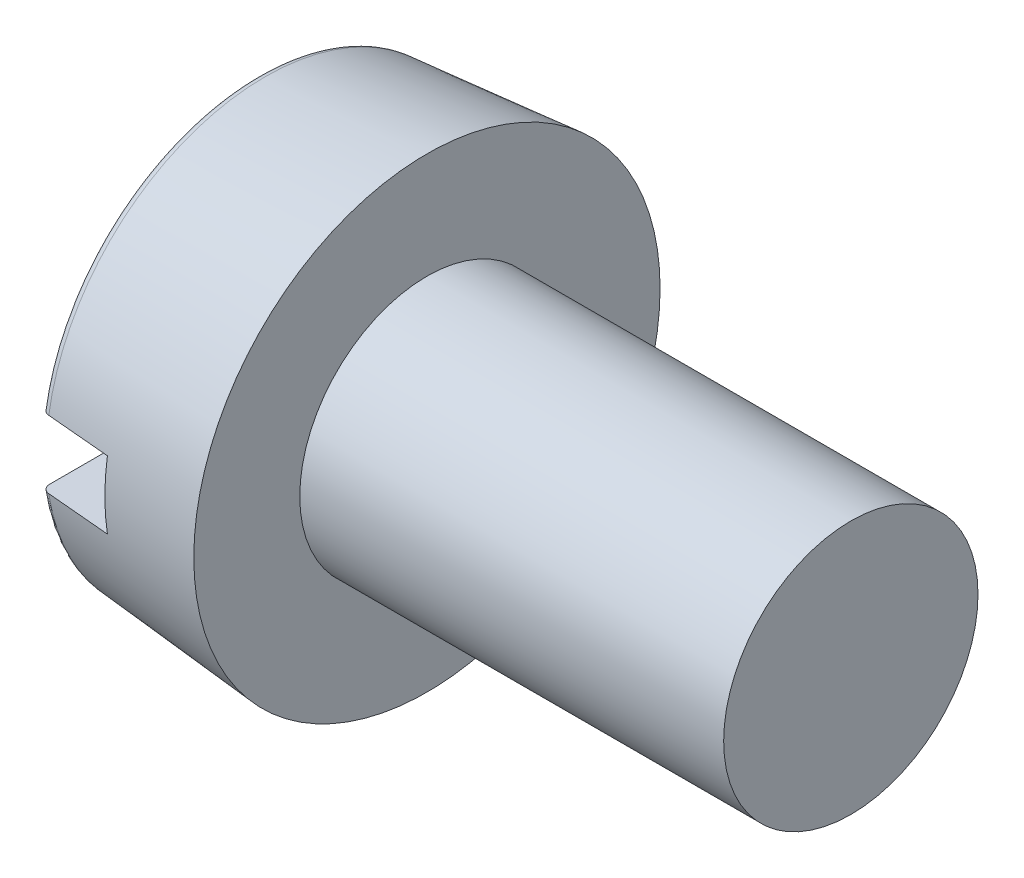
ISO-10303-21;
HEADER;
FILE_DESCRIPTION(('STEP AP214'),'2;1');
FILE_NAME('part.step','',(''),(''),'','','');
FILE_SCHEMA(('AUTOMOTIVE_DESIGN { 1 0 10303 214 1 1 1 1 }'));
ENDSEC;
DATA;
#1=APPLICATION_CONTEXT('core data for automotive mechanical design processes');
#2=APPLICATION_PROTOCOL_DEFINITION('international standard','automotive_design',2000,#1);
#3=PRODUCT_CONTEXT('',#1,'mechanical');
#4=PRODUCT('Part','Part','',(#3));
#5=PRODUCT_RELATED_PRODUCT_CATEGORY('part','',(#4));
#6=PRODUCT_DEFINITION_FORMATION('','',#4);
#7=PRODUCT_DEFINITION_CONTEXT('part definition',#1,'design');
#8=PRODUCT_DEFINITION('design','',#6,#7);
#9=PRODUCT_DEFINITION_SHAPE('','',#8);
#10=(LENGTH_UNIT() NAMED_UNIT(*) SI_UNIT(.MILLI.,.METRE.));
#11=(NAMED_UNIT(*) PLANE_ANGLE_UNIT() SI_UNIT($,.RADIAN.));
#12=(NAMED_UNIT(*) SI_UNIT($,.STERADIAN.) SOLID_ANGLE_UNIT());
#13=UNCERTAINTY_MEASURE_WITH_UNIT(LENGTH_MEASURE(1.E-05),#10,'distance_accuracy_value','');
#14=(GEOMETRIC_REPRESENTATION_CONTEXT(3) GLOBAL_UNCERTAINTY_ASSIGNED_CONTEXT((#13)) GLOBAL_UNIT_ASSIGNED_CONTEXT((#10,
#11,#12)) REPRESENTATION_CONTEXT('',''));
#15=CARTESIAN_POINT('',(0.,0.,0.));
#16=DIRECTION('',(0.,0.,1.));
#17=DIRECTION('',(1.,0.,0.));
#18=AXIS2_PLACEMENT_3D('',#15,#16,#17);
#19=CARTESIAN_POINT('',(0.,0.,0.));
#20=DIRECTION('',(-1.,0.,0.));
#21=DIRECTION('',(0.,0.,1.));
#22=AXIS2_PLACEMENT_3D('',#19,#20,#21);
#23=PLANE('',#22);
#24=DIRECTION('',(0.,0.,-1.));
#25=VECTOR('',#24,1.);
#26=CARTESIAN_POINT('',(0.,0.399999999999999,2.75));
#27=LINE('',#26,#25);
#28=CARTESIAN_POINT('',(0.,0.399999999999999,2.45096382768024));
#29=VERTEX_POINT('',#28);
#30=CARTESIAN_POINT('',(0.,0.399999999999999,-2.45096382768024));
#31=VERTEX_POINT('',#30);
#32=EDGE_CURVE('E99',#29,#31,#27,.T.);
#33=ORIENTED_EDGE('',*,*,#32,.F.);
#34=CARTESIAN_POINT('',(0.,0.,0.));
#35=DIRECTION('',(-1.,0.,0.));
#36=DIRECTION('',(0.,0.,1.));
#37=AXIS2_PLACEMENT_3D('',#34,#35,#36);
#38=CIRCLE('',#37,2.48338955554641);
#39=EDGE_CURVE('E101',#29,#31,#38,.T.);
#40=ORIENTED_EDGE('',*,*,#39,.T.);
#41=EDGE_LOOP('',(#33,#40));
#42=FACE_BOUND('',#41,.T.);
#43=ADVANCED_FACE('F31',(#42),#23,.T.);
#44=CARTESIAN_POINT('',(0.1,0.,0.));
#45=DIRECTION('',(-1.,0.,0.));
#46=DIRECTION('',(0.,0.,1.));
#47=AXIS2_PLACEMENT_3D('',#44,#45,#46);
#48=TOROIDAL_SURFACE('',#47,2.48338955554641,0.1);
#49=CARTESIAN_POINT('',(0.0485751661568925,0.399999999999999,-2.53782400375256));
#50=CARTESIAN_POINT('',(0.053335560648428,0.399999999999999,-2.54071333010714));
#51=CARTESIAN_POINT('',(0.0583417569081208,0.399999999999999,-2.5432050070476));
#52=CARTESIAN_POINT('',(0.0687050566270695,0.399999999999999,-2.54731542775851));
#53=CARTESIAN_POINT('',(0.074062533107433,0.399999999999999,-2.54893322616331));
#54=CARTESIAN_POINT('',(0.0849727450829088,0.399999999999999,-2.55124400653277));
#55=CARTESIAN_POINT('',(0.0905254381371258,0.399999999999999,-2.55193718825242));
#56=CARTESIAN_POINT('',(0.101666850403572,0.399999999999999,-2.55237774737396));
#57=CARTESIAN_POINT('',(0.107255560960916,0.399999999999999,-2.55212534411489));
#58=CARTESIAN_POINT('',(0.118292977477712,0.399999999999999,-2.55068537304434));
#59=CARTESIAN_POINT('',(0.123742072160621,0.399999999999999,-2.54950078182478));
#60=CARTESIAN_POINT('',(0.134364973548136,0.399999999999999,-2.54623584290948));
#61=CARTESIAN_POINT('',(0.139538770226996,0.399999999999999,-2.54415546261614));
#62=CARTESIAN_POINT('',(0.149479719032407,0.399999999999999,-2.53915450094368));
#63=CARTESIAN_POINT('',(0.154245774280699,0.399999999999999,-2.5362317402539));
#64=CARTESIAN_POINT('',(0.16322526708216,0.399999999999999,-2.52963434266422));
#65=CARTESIAN_POINT('',(0.167438683516509,0.399999999999999,-2.52595967704439));
#66=CARTESIAN_POINT('',(0.175235238754912,0.399999999999999,-2.51792797325945));
#67=CARTESIAN_POINT('',(0.178812290222122,0.399999999999999,-2.51356502728085));
#68=CARTESIAN_POINT('',(0.185193520606353,0.399999999999999,-2.50430657366979));
#69=CARTESIAN_POINT('',(0.187997652806075,0.399999999999999,-2.49941103387087));
#70=CARTESIAN_POINT('',(0.192789155673774,0.399999999999999,-2.48916309698215));
#71=CARTESIAN_POINT('',(0.194766254858682,0.399999999999999,-2.48380589705));
#72=CARTESIAN_POINT('',(0.197803265284973,0.399999999999999,-2.47283752208987));
#73=CARTESIAN_POINT('',(0.198863119308796,0.399999999999999,-2.46722633124097));
#74=CARTESIAN_POINT('',(0.200044847417698,0.399999999999999,-2.45584788057293));
#75=CARTESIAN_POINT('',(0.200157020578001,0.399999999999999,-2.45007961163345));
#76=CARTESIAN_POINT('',(0.199415505351017,0.399999999999999,-2.43860536306505));
#77=CARTESIAN_POINT('',(0.198561783586786,0.399999999999999,-2.43289938559553));
#78=CARTESIAN_POINT('',(0.195905910130036,0.399999999999999,-2.42168897882671));
#79=CARTESIAN_POINT('',(0.194100095750389,0.399999999999999,-2.41618541629421));
#80=CARTESIAN_POINT('',(0.189585917001447,0.399999999999999,-2.40556157634262));
#81=CARTESIAN_POINT('',(0.186877563222536,0.399999999999999,-2.40044129442698));
#82=CARTESIAN_POINT('',(0.180646274399763,0.399999999999999,-2.39075689405528));
#83=CARTESIAN_POINT('',(0.177127233156935,0.399999999999999,-2.38619027144736));
#84=CARTESIAN_POINT('',(0.16936410553569,0.399999999999999,-2.37772142685885));
#85=CARTESIAN_POINT('',(0.165120062398032,0.399999999999999,-2.37381916528196));
#86=CARTESIAN_POINT('',(0.15607995674928,0.399999999999999,-2.36683969538108));
#87=CARTESIAN_POINT('',(0.151290949374607,0.399999999999999,-2.36375335061032));
#88=CARTESIAN_POINT('',(0.141257231753731,0.399999999999999,-2.35844131597663));
#89=CARTESIAN_POINT('',(0.136012558112742,0.399999999999999,-2.35621555705808));
#90=CARTESIAN_POINT('',(0.125292467405882,0.399999999999999,-2.35271848818592));
#91=CARTESIAN_POINT('',(0.119821114682516,0.399999999999999,-2.35143471451816));
#92=CARTESIAN_POINT('',(0.10874007026053,0.399999999999999,-2.3498129641862));
#93=CARTESIAN_POINT('',(0.103130386873386,0.399999999999999,-2.34947493083703));
#94=CARTESIAN_POINT('',(0.0919839198921377,0.399999999999999,-2.34975394655982));
#95=CARTESIAN_POINT('',(0.0864469267457421,0.399999999999999,-2.3503627089689));
#96=CARTESIAN_POINT('',(0.0755538584306494,0.399999999999999,-2.35250103603832));
#97=CARTESIAN_POINT('',(0.070197781285211,0.399999999999999,-2.35403059063437));
#98=CARTESIAN_POINT('',(0.0598152881139394,0.399999999999999,-2.35796437216879));
#99=CARTESIAN_POINT('',(0.054788984276408,0.399999999999999,-2.36036889496734));
#100=CARTESIAN_POINT('',(0.0452064655420643,0.399999999999999,-2.36598034847398));
#101=CARTESIAN_POINT('',(0.0406502682628025,0.399999999999999,-2.36918730923854));
#102=CARTESIAN_POINT('',(0.0320917632238232,0.399999999999999,-2.37634229232291));
#103=CARTESIAN_POINT('',(0.028094870668272,0.399999999999999,-2.38029679006583));
#104=CARTESIAN_POINT('',(0.0208109892284708,0.399999999999999,-2.3888128469718));
#105=CARTESIAN_POINT('',(0.0175240500802504,0.399999999999999,-2.39337444862957));
#106=CARTESIAN_POINT('',(0.0117067345908032,0.399999999999999,-2.4030406846898));
#107=CARTESIAN_POINT('',(0.00918709442735062,0.399999999999999,-2.40815178065127));
#108=CARTESIAN_POINT('',(0.00503040363865618,0.399999999999999,-2.41872109198935));
#109=CARTESIAN_POINT('',(0.003393414118762,0.399999999999999,-2.42417933136926));
#110=CARTESIAN_POINT('',(0.00103079629344816,0.399999999999999,-2.4353556964236));
#111=CARTESIAN_POINT('',(0.000315915351137688,0.399999999999999,-2.44107609603135));
#112=CARTESIAN_POINT('',(-0.000148268658822335,0.399999999999999,-2.45255584173235));
#113=CARTESIAN_POINT('',(0.000102427694162917,0.399999999999999,-2.45831518780224));
#114=CARTESIAN_POINT('',(0.00156672863514033,0.399999999999999,-2.46973701475673));
#115=CARTESIAN_POINT('',(0.00278471258006267,0.399999999999999,-2.47539893515676));
#116=CARTESIAN_POINT('',(0.00615802275625762,0.399999999999999,-2.48643816300119));
#117=CARTESIAN_POINT('',(0.00831357182420383,0.399999999999999,-2.49181540244276));
#118=CARTESIAN_POINT('',(0.0134950186698162,0.399999999999999,-2.50210927446436));
#119=CARTESIAN_POINT('',(0.01651790853147,0.399999999999999,-2.50702742235159));
#120=CARTESIAN_POINT('',(0.0233527300396547,0.399999999999999,-2.51627478169689));
#121=CARTESIAN_POINT('',(0.0271636671469914,0.399999999999999,-2.52060472418424));
#122=CARTESIAN_POINT('',(0.0339390198940382,0.399999999999999,-2.52708853011278));
#123=CARTESIAN_POINT('',(0.0367007352855018,0.399999999999999,-2.52945777664795));
#124=CARTESIAN_POINT('',(0.04246511181425,0.399999999999999,-2.5338824942972));
#125=CARTESIAN_POINT('',(0.0454677714717278,0.399999999999999,-2.53593796733816));
#126=CARTESIAN_POINT('',(0.0485751661568925,0.399999999999999,-2.53782400375256));
#127=B_SPLINE_CURVE_WITH_KNOTS('',3,(#49,#50,#51,#52,#53,#54,#55,#56,#57,#58,#59,#60,#61,#62,
#63,#64,#65,#66,#67,#68,#69,#70,#71,#72,#73,#74,#75,#76,#77,#78,#79,#80,#81,#82,#83,#84,#85,#86,
#87,#88,#89,#90,#91,#92,#93,#94,#95,#96,#97,#98,#99,#100,#101,#102,#103,#104,#105,#106,#107,
#108,#109,#110,#111,#112,#113,#114,#115,#116,#117,#118,#119,#120,#121,#122,#123,#124,#125,#126),
.UNSPECIFIED.,.T.,.F.,(4,2,2,2,2,2,2,2,2,2,2,2,2,2,2,2,2,2,2,2,2,2,2,2,2,2,2,2,2,2,2,2,2,2,2,2,
2,2,4),(0.,0.0166927261929599,0.0334034746677627,0.0501106123530613,0.0668138748703243,
0.0834640171570519,0.100114765390758,0.116808983272006,0.133503838928812,0.150350686192216,
0.167198551500755,0.184249859151125,0.201302230381806,0.218528949163409,0.235756263240368,
0.253050339384405,0.270344212607132,0.287556692602934,0.304768146365554,0.321777815466104,
0.338786119383575,0.355565109802712,0.372343094515803,0.388975057176047,0.405606838051781,
0.422244248001944,0.438882281223626,0.455671655511418,0.472462205603378,0.489477908753089,
0.506494789738005,0.523708265225892,0.54092173038536,0.558213576203892,0.575509534125873,
0.592746220451118,0.609961284890882,0.620857694274182,0.631754036740157),.UNSPECIFIED.);
#128=CARTESIAN_POINT('',(0.0912844257247948,0.399999999999999,-2.55184945188353));
#129=VERTEX_POINT('',#128);
#130=EDGE_CURVE('E55',#31,#129,#127,.T.);
#131=ORIENTED_EDGE('',*,*,#130,.F.);
#132=ORIENTED_EDGE('',*,*,#39,.F.);
#133=CARTESIAN_POINT('',(0.066087136792476,0.399999999999999,2.35559521523855));
#134=CARTESIAN_POINT('',(0.0712950927848418,0.399999999999999,2.35369117822232));
#135=CARTESIAN_POINT('',(0.076666857041321,0.399999999999999,2.35222401932616));
#136=CARTESIAN_POINT('',(0.0875846729626109,0.399999999999999,2.35021144655486));
#137=CARTESIAN_POINT('',(0.0931309090012406,0.399999999999999,2.34966704357885));
#138=CARTESIAN_POINT('',(0.104234345782761,0.399999999999999,2.34951890222007));
#139=CARTESIAN_POINT('',(0.109791541651094,0.399999999999999,2.34991481223107));
#140=CARTESIAN_POINT('',(0.120758977338573,0.399999999999999,2.35163438903106));
#141=CARTESIAN_POINT('',(0.126169249425605,0.399999999999999,2.3529578503682));
#142=CARTESIAN_POINT('',(0.136691070159669,0.399999999999999,2.35649136337689));
#143=CARTESIAN_POINT('',(0.141802658139018,0.399999999999999,2.35870129801009));
#144=CARTESIAN_POINT('',(0.151586618009318,0.399999999999999,2.36394124838263));
#145=CARTESIAN_POINT('',(0.15625896099778,0.399999999999999,2.36697131803635));
#146=CARTESIAN_POINT('',(0.165074157354303,0.399999999999999,2.37379047063628));
#147=CARTESIAN_POINT('',(0.169212326798595,0.399999999999999,2.37758560642957));
#148=CARTESIAN_POINT('',(0.176803016968956,0.399999999999999,2.38580863243915));
#149=CARTESIAN_POINT('',(0.180255493017442,0.399999999999999,2.39023656385407));
#150=CARTESIAN_POINT('',(0.186425395678719,0.399999999999999,2.39966205876259));
#151=CARTESIAN_POINT('',(0.189132494897016,0.399999999999999,2.40466638257535));
#152=CARTESIAN_POINT('',(0.19367967078828,0.399999999999999,2.41505452836032));
#153=CARTESIAN_POINT('',(0.195519689004032,0.399999999999999,2.42043837589129));
#154=CARTESIAN_POINT('',(0.19830186658775,0.399999999999999,2.43150243878165));
#155=CARTESIAN_POINT('',(0.199232942923701,0.399999999999999,2.43718544303413));
#156=CARTESIAN_POINT('',(0.200133721631402,0.399999999999999,2.44862724862863));
#157=CARTESIAN_POINT('',(0.200103382520145,0.399999999999999,2.45438605323057));
#158=CARTESIAN_POINT('',(0.199078617330099,0.399999999999999,2.46584997721002));
#159=CARTESIAN_POINT('',(0.198078795088567,0.399999999999999,2.47155461557154));
#160=CARTESIAN_POINT('',(0.195132850395625,0.399999999999999,2.48271426222291));
#161=CARTESIAN_POINT('',(0.193186731461064,0.399999999999999,2.4881692714404));
#162=CARTESIAN_POINT('',(0.188406932533007,0.399999999999999,2.49865615099338));
#163=CARTESIAN_POINT('',(0.185575905837541,0.399999999999999,2.50368922996592));
#164=CARTESIAN_POINT('',(0.179101091115396,0.399999999999999,2.51320240525564));
#165=CARTESIAN_POINT('',(0.175457341207139,0.399999999999999,2.51768252749234));
#166=CARTESIAN_POINT('',(0.167497937800453,0.399999999999999,2.52591455321073));
#167=CARTESIAN_POINT('',(0.16318924419314,0.399999999999999,2.52967318474522));
#168=CARTESIAN_POINT('',(0.15399533800476,0.399999999999999,2.53640297535422));
#169=CARTESIAN_POINT('',(0.149110165043672,0.399999999999999,2.53937418850051));
#170=CARTESIAN_POINT('',(0.138966186483439,0.399999999999999,2.54440671179074));
#171=CARTESIAN_POINT('',(0.133712676926899,0.399999999999999,2.54647869854793));
#172=CARTESIAN_POINT('',(0.122930387636138,0.399999999999999,2.54970170625043));
#173=CARTESIAN_POINT('',(0.117401624409889,0.399999999999999,2.55085278235563));
#174=CARTESIAN_POINT('',(0.106281963774287,0.399999999999999,2.55219206612031));
#175=CARTESIAN_POINT('',(0.100692150468509,0.399999999999999,2.55238928817214));
#176=CARTESIAN_POINT('',(0.0895592860464738,0.399999999999999,2.55183933800322));
#177=CARTESIAN_POINT('',(0.0840162336332734,0.399999999999999,2.55109219206242));
#178=CARTESIAN_POINT('',(0.0731512358601828,0.399999999999999,2.5486799701557));
#179=CARTESIAN_POINT('',(0.0678286781135663,0.399999999999999,2.54701764956405));
#180=CARTESIAN_POINT('',(0.0575363587723267,0.399999999999999,2.54282694850188));
#181=CARTESIAN_POINT('',(0.0525666019474384,0.399999999999999,2.54029855632511));
#182=CARTESIAN_POINT('',(0.0430955298033923,0.399999999999999,2.53443716654266));
#183=CARTESIAN_POINT('',(0.03859644697394,0.399999999999999,2.53110056307376));
#184=CARTESIAN_POINT('',(0.0302151234190859,0.399999999999999,2.52372648341994));
#185=CARTESIAN_POINT('',(0.026332911338312,0.399999999999999,2.51968897470644));
#186=CARTESIAN_POINT('',(0.0192521281963954,0.399999999999999,2.51098384815932));
#187=CARTESIAN_POINT('',(0.0160610119836794,0.399999999999999,2.5063101674796));
#188=CARTESIAN_POINT('',(0.0104977647710904,0.399999999999999,2.49649850826803));
#189=CARTESIAN_POINT('',(0.00812568805622457,0.399999999999999,2.49136049898949));
#190=CARTESIAN_POINT('',(0.00423822124527566,0.399999999999999,2.48069955197134));
#191=CARTESIAN_POINT('',(0.00273352009700192,0.399999999999999,2.4751727157723));
#192=CARTESIAN_POINT('',(0.000664174238575977,0.399999999999999,2.4639457200927));
#193=CARTESIAN_POINT('',(9.95845082644665E-05,0.399999999999999,2.45824555049506));
#194=CARTESIAN_POINT('',(-7.62295306056618E-05,0.399999999999999,2.4467793069312));
#195=CARTESIAN_POINT('',(0.000321125140370979,0.399999999999999,2.44101309976124));
#196=CARTESIAN_POINT('',(0.00207635443678277,0.399999999999999,2.42962883569641));
#197=CARTESIAN_POINT('',(0.00343421550729716,0.399999999999999,2.424010776712));
#198=CARTESIAN_POINT('',(0.00707734815742831,0.399999999999999,2.41307368443565));
#199=CARTESIAN_POINT('',(0.00936409323791634,0.399999999999999,2.40775514160471));
#200=CARTESIAN_POINT('',(0.014804690681413,0.399999999999999,2.39757966614318));
#201=CARTESIAN_POINT('',(0.0179587364122395,0.399999999999999,2.39272283677864));
#202=CARTESIAN_POINT('',(0.0250240732994685,0.399999999999999,2.38364579035037));
#203=CARTESIAN_POINT('',(0.0289303931825737,0.399999999999999,2.37942170099146));
#204=CARTESIAN_POINT('',(0.0374021808573999,0.399999999999999,2.3717039963052));
#205=CARTESIAN_POINT('',(0.0419667955357711,0.399999999999999,2.36820944966134));
#206=CARTESIAN_POINT('',(0.0498248602432996,0.399999999999999,2.3632007701384));
#207=CARTESIAN_POINT('',(0.0529598990957766,0.399999999999999,2.36143340044221));
#208=CARTESIAN_POINT('',(0.0594027181877445,0.399999999999999,2.35824787663633));
#209=CARTESIAN_POINT('',(0.062710497205202,0.399999999999999,2.35682972005658));
#210=CARTESIAN_POINT('',(0.066087136792476,0.399999999999999,2.35559521523855));
#211=B_SPLINE_CURVE_WITH_KNOTS('',3,(#133,#134,#135,#136,#137,#138,#139,#140,#141,#142,#143,
#144,#145,#146,#147,#148,#149,#150,#151,#152,#153,#154,#155,#156,#157,#158,#159,#160,#161,#162,
#163,#164,#165,#166,#167,#168,#169,#170,#171,#172,#173,#174,#175,#176,#177,#178,#179,#180,#181,
#182,#183,#184,#185,#186,#187,#188,#189,#190,#191,#192,#193,#194,#195,#196,#197,#198,#199,#200,
#201,#202,#203,#204,#205,#206,#207,#208,#209,#210),.UNSPECIFIED.,.T.,.F.,(4,2,2,2,2,2,2,2,2,2,2,
2,2,2,2,2,2,2,2,2,2,2,2,2,2,2,2,2,2,2,2,2,2,2,2,2,2,2,4),(0.,0.0166222541478177,
0.0332627065942929,0.0498969377445997,0.0665274855903878,0.0831558384784712,0.0997852847538594,
0.116551858795266,0.133319524934732,0.150308994702433,0.16729960970923,0.184494901354411,
0.201690934940426,0.218983234681923,0.236275470158237,0.253516346249615,0.270756413877768,
0.287826942378045,0.304896298346318,0.321757040586668,0.338616772841758,0.355316856730833,
0.372016475898998,0.388666089268513,0.405315927691637,0.422041464353441,0.438767777445074,
0.455666404024134,0.472566150410065,0.489669935249993,0.506774720322791,0.524032613353522,
0.541290262841154,0.558575395944134,0.575864385959096,0.593042819367108,0.610199187265656,
0.620976497689188,0.631753731880016),.UNSPECIFIED.);
#212=CARTESIAN_POINT('',(0.0912844257242457,0.399999999999999,2.55184945188577));
#213=VERTEX_POINT('',#212);
#214=EDGE_CURVE('E91',#213,#29,#211,.T.);
#215=ORIENTED_EDGE('',*,*,#214,.F.);
#216=CARTESIAN_POINT('',(0.0912844257252333,0.,0.));
#217=DIRECTION('',(-1.,0.,0.));
#218=DIRECTION('',(0.,0.,1.));
#219=AXIS2_PLACEMENT_3D('',#216,#217,#218);
#220=CIRCLE('',#219,2.58300902535558);
#221=EDGE_CURVE('E105',#129,#213,#220,.F.);
#222=ORIENTED_EDGE('',*,*,#221,.F.);
#223=EDGE_LOOP('',(#131,#132,#215,#222));
#224=FACE_BOUND('',#223,.T.);
#225=ADVANCED_FACE('F176',(#224),#48,.T.);
#226=CARTESIAN_POINT('',(-25.4,0.,0.));
#227=DIRECTION('',(-1.,0.,0.));
#228=DIRECTION('',(0.,0.,1.));
#229=AXIS2_PLACEMENT_3D('',#226,#227,#228);
#230=CYLINDRICAL_SURFACE('',#229,1.5);
#231=CARTESIAN_POINT('',(7.,0.,0.));
#232=DIRECTION('',(-1.,0.,0.));
#233=DIRECTION('',(0.,0.,1.));
#234=AXIS2_PLACEMENT_3D('',#231,#232,#233);
#235=CIRCLE('',#234,1.5);
#236=CARTESIAN_POINT('',(7.,0.,1.5));
#237=VERTEX_POINT('',#236);
#238=EDGE_CURVE('E102',#237,#237,#235,.T.);
#239=ORIENTED_EDGE('',*,*,#238,.T.);
#240=EDGE_LOOP('',(#239));
#241=FACE_BOUND('',#240,.T.);
#242=CARTESIAN_POINT('',(2.,0.,0.));
#243=DIRECTION('',(-1.,0.,0.));
#244=DIRECTION('',(0.,0.,1.));
#245=AXIS2_PLACEMENT_3D('',#242,#243,#244);
#246=CIRCLE('',#245,1.5);
#247=CARTESIAN_POINT('',(2.,0.,1.5));
#248=VERTEX_POINT('',#247);
#249=EDGE_CURVE('E163',#248,#248,#246,.T.);
#250=ORIENTED_EDGE('',*,*,#249,.F.);
#251=EDGE_LOOP('',(#250));
#252=FACE_BOUND('',#251,.T.);
#253=ADVANCED_FACE('F173',(#241,#252),#230,.T.);
#254=CARTESIAN_POINT('',(7.,1.5,0.));
#255=DIRECTION('',(1.,0.,0.));
#256=DIRECTION('',(0.,0.,-1.));
#257=AXIS2_PLACEMENT_3D('',#254,#255,#256);
#258=PLANE('',#257);
#259=ORIENTED_EDGE('',*,*,#238,.F.);
#260=EDGE_LOOP('',(#259));
#261=FACE_BOUND('',#260,.T.);
#262=ADVANCED_FACE('F175',(#261),#258,.T.);
#263=DIRECTION('',(0.,0.,1.));
#264=VECTOR('',#263,1.);
#265=CARTESIAN_POINT('',(0.,-0.4,-2.75));
#266=LINE('',#265,#264);
#267=CARTESIAN_POINT('',(0.,-0.4,-2.45096382768024));
#268=VERTEX_POINT('',#267);
#269=CARTESIAN_POINT('',(0.,-0.4,2.45096382768024));
#270=VERTEX_POINT('',#269);
#271=EDGE_CURVE('E47',#268,#270,#266,.T.);
#272=ORIENTED_EDGE('',*,*,#271,.F.);
#273=EDGE_CURVE('E97',#268,#270,#38,.T.);
#274=ORIENTED_EDGE('',*,*,#273,.T.);
#275=EDGE_LOOP('',(#272,#274));
#276=FACE_BOUND('',#275,.T.);
#277=ADVANCED_FACE('F96',(#276),#23,.T.);
#278=CARTESIAN_POINT('',(0.,0.,0.));
#279=DIRECTION('',(1.,0.,0.));
#280=DIRECTION('',(0.,0.,-1.));
#281=AXIS2_PLACEMENT_3D('',#278,#279,#280);
#282=CONICAL_SURFACE('',#281,2.57502267294815,0.0872664625997164);
#283=CARTESIAN_POINT('',(5.21123588736544,0.399999999999999,3.00443640584799));
#284=CARTESIAN_POINT('',(4.41342358696222,0.399999999999999,2.93401988873196));
#285=CARTESIAN_POINT('',(3.61561486907634,0.399999999999999,2.86356274948076));
#286=CARTESIAN_POINT('',(2.0200069246513,0.399999999999999,2.72254136292326));
#287=CARTESIAN_POINT('',(1.22220769811185,0.399999999999999,2.65197711562021));
#288=CARTESIAN_POINT('',(-0.373378996688641,0.399999999999999,2.51071564393346));
#289=CARTESIAN_POINT('',(-1.17116646494953,0.399999999999999,2.44001841954794));
#290=CARTESIAN_POINT('',(-2.76672581923324,0.399999999999999,2.298448092182));
#291=CARTESIAN_POINT('',(-3.56449770525557,0.399999999999999,2.22757498919618));
#292=CARTESIAN_POINT('',(-4.36225986914578,0.399999999999999,2.15659249784001));
#293=B_SPLINE_CURVE_WITH_KNOTS('',3,(#283,#284,#285,#286,#287,#288,#289,#290,#291,#292),
.UNSPECIFIED.,.F.,.F.,(4,2,2,2,4),(0.,2.40274147318214,4.80548287330205,7.20822430613117,
9.6109658126378),.UNSPECIFIED.);
#294=CARTESIAN_POINT('',(0.85,0.399999999999999,2.61901832187334));
#295=VERTEX_POINT('',#294);
#296=EDGE_CURVE('E154',#295,#213,#293,.T.);
#297=ORIENTED_EDGE('',*,*,#296,.F.);
#298=CARTESIAN_POINT('',(0.85,0.,0.));
#299=DIRECTION('',(1.,0.,0.));
#300=DIRECTION('',(0.,0.,-1.));
#301=AXIS2_PLACEMENT_3D('',#298,#299,#300);
#302=CIRCLE('',#301,2.64938803694519);
#303=CARTESIAN_POINT('',(0.85,-0.4,2.61901832187334));
#304=VERTEX_POINT('',#303);
#305=EDGE_CURVE('E11',#304,#295,#302,.F.);
#306=ORIENTED_EDGE('',*,*,#305,.F.);
#307=CARTESIAN_POINT('',(-4.36225986914578,-0.4,2.15659249784001));
#308=CARTESIAN_POINT('',(-3.0225287932993,-0.4,2.27578971400985));
#309=CARTESIAN_POINT('',(-1.68277158070832,-0.4,2.3946924855258));
#310=CARTESIAN_POINT('',(-0.087192971572953,-0.4,2.5360455579839));
#311=CARTESIAN_POINT('',(0.168610376643268,-0.4,2.55869953286896));
#312=CARTESIAN_POINT('',(2.02000114161503,-0.4,2.72260692865391));
#313=CARTESIAN_POINT('',(3.61561248830953,-0.4,2.86359016848939));
#314=CARTESIAN_POINT('',(5.21123588736544,-0.4,3.00443640584799));
#315=B_SPLINE_CURVE_WITH_KNOTS('',3,(#307,#308,#309,#310,#311,#312,#313,#314),.UNSPECIFIED.,.F.,
.F.,(4,2,2,4),(0.,4.03506939923899,4.80548292410975,9.61096578658458),.UNSPECIFIED.);
#316=CARTESIAN_POINT('',(0.0912844257252334,-0.4,2.5518494518816));
#317=VERTEX_POINT('',#316);
#318=EDGE_CURVE('E132',#317,#304,#315,.T.);
#319=ORIENTED_EDGE('',*,*,#318,.F.);
#320=CARTESIAN_POINT('',(0.0912844257252334,-0.4,-2.55184945188164));
#321=VERTEX_POINT('',#320);
#322=EDGE_CURVE('E111',#317,#321,#220,.F.);
#323=ORIENTED_EDGE('',*,*,#322,.T.);
#324=CARTESIAN_POINT('',(5.21123588736544,-0.4,-3.00443640584799));
#325=CARTESIAN_POINT('',(4.41342358696222,-0.4,-2.93401988873196));
#326=CARTESIAN_POINT('',(3.61561486907634,-0.4,-2.86356274948076));
#327=CARTESIAN_POINT('',(2.0200069246513,-0.4,-2.72254136292326));
#328=CARTESIAN_POINT('',(1.22220769811185,-0.4,-2.65197711562021));
#329=CARTESIAN_POINT('',(-0.373378996688641,-0.4,-2.51071564393346));
#330=CARTESIAN_POINT('',(-1.17116646494953,-0.4,-2.44001841954794));
#331=CARTESIAN_POINT('',(-2.76672581923324,-0.4,-2.298448092182));
#332=CARTESIAN_POINT('',(-3.56449770525557,-0.4,-2.22757498919618));
#333=CARTESIAN_POINT('',(-4.36225986914578,-0.4,-2.15659249784001));
#334=B_SPLINE_CURVE_WITH_KNOTS('',3,(#324,#325,#326,#327,#328,#329,#330,#331,#332,#333),
.UNSPECIFIED.,.F.,.F.,(4,2,2,2,4),(0.,2.40274147318214,4.80548287330205,7.20822430613117,
9.6109658126378),.UNSPECIFIED.);
#335=CARTESIAN_POINT('',(0.85,-0.4,-2.61901832187334));
#336=VERTEX_POINT('',#335);
#337=EDGE_CURVE('E86',#336,#321,#334,.T.);
#338=ORIENTED_EDGE('',*,*,#337,.F.);
#339=CARTESIAN_POINT('',(0.85,0.399999999999999,-2.61901832187334));
#340=VERTEX_POINT('',#339);
#341=EDGE_CURVE('E36',#340,#336,#302,.F.);
#342=ORIENTED_EDGE('',*,*,#341,.F.);
#343=CARTESIAN_POINT('',(-4.36225986914578,0.399999999999999,-2.15659249784001));
#344=CARTESIAN_POINT('',(-3.0225287932993,0.399999999999999,-2.27578971400985));
#345=CARTESIAN_POINT('',(-1.68277158070832,0.399999999999999,-2.3946924855258));
#346=CARTESIAN_POINT('',(-0.087192971572953,0.399999999999999,-2.5360455579839));
#347=CARTESIAN_POINT('',(0.168610376643268,0.399999999999999,-2.55869953286896));
#348=CARTESIAN_POINT('',(2.02000114161503,0.399999999999999,-2.72260692865391));
#349=CARTESIAN_POINT('',(3.61561248830953,0.399999999999999,-2.86359016848939));
#350=CARTESIAN_POINT('',(5.21123588736544,0.399999999999999,-3.00443640584799));
#351=B_SPLINE_CURVE_WITH_KNOTS('',3,(#343,#344,#345,#346,#347,#348,#349,#350),.UNSPECIFIED.,.F.,
.F.,(4,2,2,4),(0.,4.03506939923899,4.80548292410975,9.61096578658458),.UNSPECIFIED.);
#352=EDGE_CURVE('E158',#129,#340,#351,.T.);
#353=ORIENTED_EDGE('',*,*,#352,.F.);
#354=ORIENTED_EDGE('',*,*,#221,.T.);
#355=EDGE_LOOP('',(#297,#306,#319,#323,#338,#342,#353,#354));
#356=FACE_BOUND('',#355,.T.);
#357=CARTESIAN_POINT('',(2.,0.,0.));
#358=DIRECTION('',(-1.,0.,0.));
#359=DIRECTION('',(0.,0.,1.));
#360=AXIS2_PLACEMENT_3D('',#357,#358,#359);
#361=CIRCLE('',#360,2.75);
#362=CARTESIAN_POINT('',(2.,0.,2.75));
#363=VERTEX_POINT('',#362);
#364=EDGE_CURVE('E107',#363,#363,#361,.T.);
#365=ORIENTED_EDGE('',*,*,#364,.T.);
#366=EDGE_LOOP('',(#365));
#367=FACE_BOUND('',#366,.T.);
#368=ADVANCED_FACE('F143',(#356,#367),#282,.T.);
#369=CARTESIAN_POINT('',(2.,1.5,0.));
#370=DIRECTION('',(-1.,0.,0.));
#371=DIRECTION('',(0.,0.,1.));
#372=AXIS2_PLACEMENT_3D('',#369,#370,#371);
#373=PLANE('',#372);
#374=ORIENTED_EDGE('',*,*,#364,.F.);
#375=EDGE_LOOP('',(#374));
#376=FACE_BOUND('',#375,.T.);
#377=ORIENTED_EDGE('',*,*,#249,.T.);
#378=EDGE_LOOP('',(#377));
#379=FACE_BOUND('',#378,.T.);
#380=ADVANCED_FACE('F147',(#376,#379),#373,.F.);
#381=CARTESIAN_POINT('',(0.0485751661568924,-0.4,-2.53782400375256));
#382=CARTESIAN_POINT('',(0.043742700889073,-0.4,-2.53489033603248));
#383=CARTESIAN_POINT('',(0.0391565039520058,-0.4,-2.53154249233901));
#384=CARTESIAN_POINT('',(0.0306096912349645,-0.4,-2.52411912703245));
#385=CARTESIAN_POINT('',(0.0266499199134283,-0.4,-2.52004263865816));
#386=CARTESIAN_POINT('',(0.0194724144414637,-0.4,-2.51128827187889));
#387=CARTESIAN_POINT('',(0.0162539430758686,-0.4,-2.5066109982245));
#388=CARTESIAN_POINT('',(0.0106407914468132,-0.4,-2.49678789814068));
#389=CARTESIAN_POINT('',(0.00824590952942974,-0.4,-2.4916421867979));
#390=CARTESIAN_POINT('',(0.00432284245737381,-0.4,-2.48097764448566));
#391=CARTESIAN_POINT('',(0.00280265847762437,-0.4,-2.47545587010949));
#392=CARTESIAN_POINT('',(0.000701595208248543,-0.4,-2.46423612609241));
#393=CARTESIAN_POINT('',(0.000120808101596112,-0.4,-2.45853813921568));
#394=CARTESIAN_POINT('',(-8.77639340342732E-05,-0.4,-2.44707338759541));
#395=CARTESIAN_POINT('',(0.000293055254025186,-0.4,-2.44130646469098));
#396=CARTESIAN_POINT('',(0.00201549855238157,-0.4,-2.42991778305268));
#397=CARTESIAN_POINT('',(0.00335714465243868,-0.4,-2.42429602764421));
#398=CARTESIAN_POINT('',(0.00696895281533291,-0.4,-2.41334782418293));
#399=CARTESIAN_POINT('',(0.0092407561566746,-0.4,-2.40802191712191));
#400=CARTESIAN_POINT('',(0.0146521431767619,-0.4,-2.39783066596844));
#401=CARTESIAN_POINT('',(0.0177917032773429,-0.4,-2.39296530936701));
#402=CARTESIAN_POINT('',(0.0248287411053429,-0.4,-2.38387042526437));
#403=CARTESIAN_POINT('',(0.0287209141925619,-0.4,-2.37963679509589));
#404=CARTESIAN_POINT('',(0.0371689847043463,-0.4,-2.37189344325919));
#405=CARTESIAN_POINT('',(0.0417248374973375,-0.4,-2.36838367295066));
#406=CARTESIAN_POINT('',(0.0513088940529644,-0.4,-2.36223607999804));
#407=CARTESIAN_POINT('',(0.0563303170031117,-0.4,-2.35958768701902));
#408=CARTESIAN_POINT('',(0.0667506637390622,-0.4,-2.35518417776549));
#409=CARTESIAN_POINT('',(0.0721495575296707,-0.4,-2.35342899060518));
#410=CARTESIAN_POINT('',(0.0830969218561982,-0.4,-2.35088371920364));
#411=CARTESIAN_POINT('',(0.0886425771214799,-0.4,-2.35008151768943));
#412=CARTESIAN_POINT('',(0.0997895698319816,-0.4,-2.34942645825663));
#413=CARTESIAN_POINT('',(0.105390904537026,-0.4,-2.34957355384856));
#414=CARTESIAN_POINT('',(0.11645098948353,-0.4,-2.35080823875911));
#415=CARTESIAN_POINT('',(0.121910439899224,-0.4,-2.35188957154329));
#416=CARTESIAN_POINT('',(0.132571054932581,-0.4,-2.35495102017176));
#417=CARTESIAN_POINT('',(0.137772218979376,-0.4,-2.35693113800247));
#418=CARTESIAN_POINT('',(0.147785607499862,-0.4,-2.36173694974296));
#419=CARTESIAN_POINT('',(0.152596707655125,-0.4,-2.36456498478211));
#420=CARTESIAN_POINT('',(0.161682450459402,-0.4,-2.37098051347151));
#421=CARTESIAN_POINT('',(0.165957067006595,-0.4,-2.3745680440511));
#422=CARTESIAN_POINT('',(0.173898476720826,-0.4,-2.38244089229649));
#423=CARTESIAN_POINT('',(0.177558250715632,-0.4,-2.38673328868116));
#424=CARTESIAN_POINT('',(0.184116745306164,-0.4,-2.39586460061934));
#425=CARTESIAN_POINT('',(0.187015411909098,-0.4,-2.40070355491074));
#426=CARTESIAN_POINT('',(0.1920102965789,-0.4,-2.41086084949244));
#427=CARTESIAN_POINT('',(0.194095133740737,-0.4,-2.41618478733958));
#428=CARTESIAN_POINT('',(0.197351618314204,-0.4,-2.42710502099882));
#429=CARTESIAN_POINT('',(0.198523208401552,-0.4,-2.43270133388441));
#430=CARTESIAN_POINT('',(0.199929764454566,-0.4,-2.44406834904126));
#431=CARTESIAN_POINT('',(0.200155100074746,-0.4,-2.44984024500279));
#432=CARTESIAN_POINT('',(0.199636288045938,-0.4,-2.4613404318168));
#433=CARTESIAN_POINT('',(0.198892115679426,-0.4,-2.46706872155379));
#434=CARTESIAN_POINT('',(0.196450104345965,-0.4,-2.47833342633219));
#435=CARTESIAN_POINT('',(0.19474990339858,-0.4,-2.48386932995355));
#436=CARTESIAN_POINT('',(0.190438851147456,-0.4,-2.49457461930592));
#437=CARTESIAN_POINT('',(0.18782801704074,-0.4,-2.49974401195617));
#438=CARTESIAN_POINT('',(0.181784168210251,-0.4,-2.50953562475824));
#439=CARTESIAN_POINT('',(0.178356081275477,-0.4,-2.51416088532287));
#440=CARTESIAN_POINT('',(0.170763854311404,-0.4,-2.52276187931021));
#441=CARTESIAN_POINT('',(0.166599755887441,-0.4,-2.52673764942296));
#442=CARTESIAN_POINT('',(0.157703749960624,-0.4,-2.53387831326103));
#443=CARTESIAN_POINT('',(0.152978790793141,-0.4,-2.53705186263633));
#444=CARTESIAN_POINT('',(0.143058302597856,-0.4,-2.54254944807672));
#445=CARTESIAN_POINT('',(0.137862824904437,-0.4,-2.54487357667608));
#446=CARTESIAN_POINT('',(0.127215096181337,-0.4,-2.54857855240269));
#447=CARTESIAN_POINT('',(0.121766627201615,-0.4,-2.54997027378005));
#448=CARTESIAN_POINT('',(0.110711267088449,-0.4,-2.55181190787766));
#449=CARTESIAN_POINT('',(0.105104343718791,-0.4,-2.55226162753717));
#450=CARTESIAN_POINT('',(0.093934771500752,-0.4,-2.552205294953));
#451=CARTESIAN_POINT('',(0.0883720843451993,-0.4,-2.55170582304087));
#452=CARTESIAN_POINT('',(0.0774146742968078,-0.4,-2.54977933214903));
#453=CARTESIAN_POINT('',(0.0720197510015749,-0.4,-2.54835346819235));
#454=CARTESIAN_POINT('',(0.0636134861796509,-0.4,-2.54535751471385));
#455=CARTESIAN_POINT('',(0.0605001894166271,-0.4,-2.54406538475537));
#456=CARTESIAN_POINT('',(0.0544205154682464,-0.4,-2.54117250369181));
#457=CARTESIAN_POINT('',(0.0514541373617044,-0.4,-2.53957175452209));
#458=CARTESIAN_POINT('',(0.0485751661568924,-0.4,-2.53782400375256));
#459=B_SPLINE_CURVE_WITH_KNOTS('',3,(#381,#382,#383,#384,#385,#386,#387,#388,#389,#390,#391,
#392,#393,#394,#395,#396,#397,#398,#399,#400,#401,#402,#403,#404,#405,#406,#407,#408,#409,#410,
#411,#412,#413,#414,#415,#416,#417,#418,#419,#420,#421,#422,#423,#424,#425,#426,#427,#428,#429,
#430,#431,#432,#433,#434,#435,#436,#437,#438,#439,#440,#441,#442,#443,#444,#445,#446,#447,#448,
#449,#450,#451,#452,#453,#454,#455,#456,#457,#458),.UNSPECIFIED.,.T.,.F.,(4,2,2,2,2,2,2,2,2,2,2,
2,2,2,2,2,2,2,2,2,2,2,2,2,2,2,2,2,2,2,2,2,2,2,2,2,2,2,4),(0.,0.016947240732267,0.03391713616015,
0.0508700816238964,0.0678188732388516,0.0849203328631082,0.102023470551057,0.119280182389639,
0.136537289182897,0.153824978576453,0.171112198285483,0.188281743401668,0.205450134421422,
0.222399111451824,0.239346743182753,0.256076496133358,0.272805429792138,0.289423191548409,
0.306040990031791,0.322705100111853,0.339370020645595,0.356213876748639,0.373058927428501,
0.390131760531073,0.407205665204685,0.424452921752968,0.441700618027207,0.458991115172603,
0.476281285810014,0.493469727421072,0.510657197712653,0.527650439747464,0.544641830018657,
0.561431437560975,0.578224485752214,0.594901539591071,0.611557840324385,0.621654327588065,
0.631750751538409),.UNSPECIFIED.);
#460=EDGE_CURVE('E82',#321,#268,#459,.T.);
#461=ORIENTED_EDGE('',*,*,#460,.F.);
#462=ORIENTED_EDGE('',*,*,#322,.F.);
#463=CARTESIAN_POINT('',(0.066087136792476,-0.4,2.35559521523855));
#464=CARTESIAN_POINT('',(0.0608105945502048,-0.4,2.35752487852842));
#465=CARTESIAN_POINT('',(0.0556944752428517,-0.4,2.3599059129028));
#466=CARTESIAN_POINT('',(0.0459323966354493,-0.4,2.36549830449194));
#467=CARTESIAN_POINT('',(0.041287068719781,-0.4,2.36871075675094));
#468=CARTESIAN_POINT('',(0.032604379070266,-0.4,2.37586468923515));
#469=CARTESIAN_POINT('',(0.0285663918791529,-0.4,2.37980541001391));
#470=CARTESIAN_POINT('',(0.0212026684834657,-0.4,2.38830165313251));
#471=CARTESIAN_POINT('',(0.0178767642753714,-0.4,2.39285703004061));
#472=CARTESIAN_POINT('',(0.0119934549886913,-0.4,2.4025019984765));
#473=CARTESIAN_POINT('',(0.00944402228749046,-0.4,2.40759645260631));
#474=CARTESIAN_POINT('',(0.00522519796804258,-0.4,2.41813782358851));
#475=CARTESIAN_POINT('',(0.00355590002102171,-0.4,2.42358477788764));
#476=CARTESIAN_POINT('',(0.00112661898390325,-0.4,2.43474435525461));
#477=CARTESIAN_POINT('',(0.000377433998971239,-0.4,2.44045933087073));
#478=CARTESIAN_POINT('',(-0.000155971609908974,-0.4,2.45193424749558));
#479=CARTESIAN_POINT('',(5.98437539214584E-05,-0.4,2.45769419017327));
#480=CARTESIAN_POINT('',(0.00145482264639189,-0.4,2.4691245835607));
#481=CARTESIAN_POINT('',(0.00263861487831221,-0.4,2.47479447055272));
#482=CARTESIAN_POINT('',(0.00594479382623159,-0.4,2.48585382181204));
#483=CARTESIAN_POINT('',(0.0080671709482321,-0.4,2.4912432889451));
#484=CARTESIAN_POINT('',(0.0131842826089136,-0.4,2.50156580381608));
#485=CARTESIAN_POINT('',(0.0161757093406995,-0.4,2.50650049043758));
#486=CARTESIAN_POINT('',(0.0229526816297058,-0.4,2.51579078048696));
#487=CARTESIAN_POINT('',(0.0267381882112737,-0.4,2.52014641231933));
#488=CARTESIAN_POINT('',(0.0349549522819582,-0.4,2.52810621279062));
#489=CARTESIAN_POINT('',(0.0393791679507018,-0.4,2.53171764933511));
#490=CARTESIAN_POINT('',(0.0487773745070072,-0.4,2.53813557351638));
#491=CARTESIAN_POINT('',(0.0537513271234718,-0.4,2.54094211713863));
#492=CARTESIAN_POINT('',(0.0640426596902495,-0.4,2.54563498979798));
#493=CARTESIAN_POINT('',(0.0693551226039386,-0.4,2.5475321037118));
#494=CARTESIAN_POINT('',(0.0802247129351556,-0.4,2.55039839200113));
#495=CARTESIAN_POINT('',(0.0857818262597894,-0.4,2.55136761975382));
#496=CARTESIAN_POINT('',(0.0969295068477404,-0.4,2.55234385612009));
#497=CARTESIAN_POINT('',(0.102519326325114,-0.4,2.55235942192522));
#498=CARTESIAN_POINT('',(0.113621717842258,-0.4,2.55144947170831));
#499=CARTESIAN_POINT('',(0.119134291728872,-0.4,2.55052397822485));
#500=CARTESIAN_POINT('',(0.12991315715357,-0.4,2.54776325488686));
#501=CARTESIAN_POINT('',(0.135179979695444,-0.4,2.54593009634288));
#502=CARTESIAN_POINT('',(0.14533338195721,-0.4,2.54141002564133));
#503=CARTESIAN_POINT('',(0.150219955236063,-0.4,2.53872309902571));
#504=CARTESIAN_POINT('',(0.159502666916409,-0.4,2.5325586246071));
#505=CARTESIAN_POINT('',(0.163896113948941,-0.4,2.52907702558495));
#506=CARTESIAN_POINT('',(0.172043834916818,-0.4,2.52143276158102));
#507=CARTESIAN_POINT('',(0.175798076961159,-0.4,2.51727006263833));
#508=CARTESIAN_POINT('',(0.182604163786229,-0.4,2.50833478591539));
#509=CARTESIAN_POINT('',(0.185648086206779,-0.4,2.50355617440357));
#510=CARTESIAN_POINT('',(0.19090152145622,-0.4,2.49356047830666));
#511=CARTESIAN_POINT('',(0.193110979885753,-0.4,2.4883433651624));
#512=CARTESIAN_POINT('',(0.196659930990868,-0.4,2.47755170451601));
#513=CARTESIAN_POINT('',(0.197988676101266,-0.4,2.47197362162933));
#514=CARTESIAN_POINT('',(0.199699497616489,-0.4,2.46067407504842));
#515=CARTESIAN_POINT('',(0.20008152317449,-0.4,2.45495260366968));
#516=CARTESIAN_POINT('',(0.199888693786855,-0.4,2.44347761139864));
#517=CARTESIAN_POINT('',(0.199305786466706,-0.4,2.43772422417512));
#518=CARTESIAN_POINT('',(0.197183396962278,-0.4,2.42639649613519));
#519=CARTESIAN_POINT('',(0.195643893907937,-0.4,2.42082215922791));
#520=CARTESIAN_POINT('',(0.191647358782498,-0.4,2.41000689513081));
#521=CARTESIAN_POINT('',(0.189189525029139,-0.4,2.40476626395098));
#522=CARTESIAN_POINT('',(0.183422446278924,-0.4,2.39477626653133));
#523=CARTESIAN_POINT('',(0.180113225729292,-0.4,2.39002688619092));
#524=CARTESIAN_POINT('',(0.172762307166356,-0.4,2.38119455975028));
#525=CARTESIAN_POINT('',(0.168726370035366,-0.4,2.37710682086271));
#526=CARTESIAN_POINT('',(0.160017645288822,-0.4,2.36967805871209));
#527=CARTESIAN_POINT('',(0.155344928487097,-0.4,2.36633695252778));
#528=CARTESIAN_POINT('',(0.145561135599925,-0.4,2.36054338093363));
#529=CARTESIAN_POINT('',(0.140456663489582,-0.4,2.35807976269219));
#530=CARTESIAN_POINT('',(0.129901516966528,-0.4,2.35405629153212));
#531=CARTESIAN_POINT('',(0.124450780981881,-0.4,2.35249659984984));
#532=CARTESIAN_POINT('',(0.113430211306763,-0.4,2.35034396470641));
#533=CARTESIAN_POINT('',(0.107862588812257,-0.4,2.34973965558371));
#534=CARTESIAN_POINT('',(0.0967101969668429,-0.4,2.34948171969541));
#535=CARTESIAN_POINT('',(0.091125458824731,-0.4,2.34982687285342));
#536=CARTESIAN_POINT('',(0.0822854426850392,-0.4,2.35112999215385));
#537=CARTESIAN_POINT('',(0.0789835903303949,-0.4,2.35179110990866));
#538=CARTESIAN_POINT('',(0.072464361176774,-0.4,2.35344593540385));
#539=CARTESIAN_POINT('',(0.0692469836329172,-0.4,2.3544396402105));
#540=CARTESIAN_POINT('',(0.066087136792476,-0.4,2.35559521523855));
#541=B_SPLINE_CURVE_WITH_KNOTS('',3,(#463,#464,#465,#466,#467,#468,#469,#470,#471,#472,#473,
#474,#475,#476,#477,#478,#479,#480,#481,#482,#483,#484,#485,#486,#487,#488,#489,#490,#491,#492,
#493,#494,#495,#496,#497,#498,#499,#500,#501,#502,#503,#504,#505,#506,#507,#508,#509,#510,#511,
#512,#513,#514,#515,#516,#517,#518,#519,#520,#521,#522,#523,#524,#525,#526,#527,#528,#529,#530,
#531,#532,#533,#534,#535,#536,#537,#538,#539,#540),.UNSPECIFIED.,.T.,.F.,(4,2,2,2,2,2,2,2,2,2,2,
2,2,2,2,2,2,2,2,2,2,2,2,2,2,2,2,2,2,2,2,2,2,2,2,2,2,2,4),(0.,0.0168424750743688,
0.0337072469428218,0.0505545302746078,0.0673978343938477,0.0844086595317174,0.101421294737152,
0.118631732868636,0.13584281283471,0.153136677947412,0.170430366290294,0.187659074407731,
0.204886937089933,0.221937615090733,0.238987106819418,0.255829075426629,0.272670075131689,
0.289359938509869,0.306049402171548,0.322700954454501,0.33935278873664,0.35609148862303,
0.372831023386549,0.389749176795124,0.406668432921035,0.423790533399583,0.440913553459407,
0.458180186872609,0.475447197005396,0.492729316207192,0.510010939215389,0.527161157578304,
0.54430947028508,0.561231319691048,0.578156186574315,0.594878150313084,0.611578636064082,
0.62166480777393,0.631750890516262),.UNSPECIFIED.);
#542=EDGE_CURVE('E92',#270,#317,#541,.T.);
#543=ORIENTED_EDGE('',*,*,#542,.F.);
#544=ORIENTED_EDGE('',*,*,#273,.F.);
#545=EDGE_LOOP('',(#461,#462,#543,#544));
#546=FACE_BOUND('',#545,.T.);
#547=ADVANCED_FACE('F33',(#546),#48,.T.);
#548=CARTESIAN_POINT('',(0.85,0.399999999999999,2.75));
#549=DIRECTION('',(0.,1.,0.));
#550=DIRECTION('',(0.,0.,1.));
#551=AXIS2_PLACEMENT_3D('',#548,#549,#550);
#552=PLANE('',#551);
#553=ORIENTED_EDGE('',*,*,#352,.T.);
#554=DIRECTION('',(0.,0.,-1.));
#555=VECTOR('',#554,1.);
#556=CARTESIAN_POINT('',(0.85,0.399999999999999,2.75));
#557=LINE('',#556,#555);
#558=EDGE_CURVE('E98',#295,#340,#557,.T.);
#559=ORIENTED_EDGE('',*,*,#558,.F.);
#560=ORIENTED_EDGE('',*,*,#296,.T.);
#561=ORIENTED_EDGE('',*,*,#214,.T.);
#562=ORIENTED_EDGE('',*,*,#32,.T.);
#563=ORIENTED_EDGE('',*,*,#130,.T.);
#564=EDGE_LOOP('',(#553,#559,#560,#561,#562,#563));
#565=FACE_BOUND('',#564,.T.);
#566=ADVANCED_FACE('F124',(#565),#552,.F.);
#567=CARTESIAN_POINT('',(0.85,-0.4,-2.75));
#568=DIRECTION('',(0.,-1.,0.));
#569=DIRECTION('',(0.,0.,-1.));
#570=AXIS2_PLACEMENT_3D('',#567,#568,#569);
#571=PLANE('',#570);
#572=ORIENTED_EDGE('',*,*,#337,.T.);
#573=ORIENTED_EDGE('',*,*,#460,.T.);
#574=ORIENTED_EDGE('',*,*,#271,.T.);
#575=ORIENTED_EDGE('',*,*,#542,.T.);
#576=ORIENTED_EDGE('',*,*,#318,.T.);
#577=DIRECTION('',(0.,0.,1.));
#578=VECTOR('',#577,1.);
#579=CARTESIAN_POINT('',(0.85,-0.4,-2.75));
#580=LINE('',#579,#578);
#581=EDGE_CURVE('E137',#336,#304,#580,.T.);
#582=ORIENTED_EDGE('',*,*,#581,.F.);
#583=EDGE_LOOP('',(#572,#573,#574,#575,#576,#582));
#584=FACE_BOUND('',#583,.T.);
#585=ADVANCED_FACE('F83',(#584),#571,.F.);
#586=CARTESIAN_POINT('',(0.85,-0.4,-2.75));
#587=DIRECTION('',(1.,0.,0.));
#588=DIRECTION('',(0.,0.,-1.));
#589=AXIS2_PLACEMENT_3D('',#586,#587,#588);
#590=PLANE('',#589);
#591=ORIENTED_EDGE('',*,*,#305,.T.);
#592=ORIENTED_EDGE('',*,*,#558,.T.);
#593=ORIENTED_EDGE('',*,*,#341,.T.);
#594=ORIENTED_EDGE('',*,*,#581,.T.);
#595=EDGE_LOOP('',(#591,#592,#593,#594));
#596=FACE_BOUND('',#595,.T.);
#597=ADVANCED_FACE('F123',(#596),#590,.F.);
#598=CLOSED_SHELL('',(#43,#225,#253,#262,#277,#368,#380,#547,#566,#585,#597));
#599=MANIFOLD_SOLID_BREP('B2',#598);
#600=ADVANCED_BREP_SHAPE_REPRESENTATION('',(#18,#599),#14);
#601=SHAPE_DEFINITION_REPRESENTATION(#9,#600);
ENDSEC;
END-ISO-10303-21;
